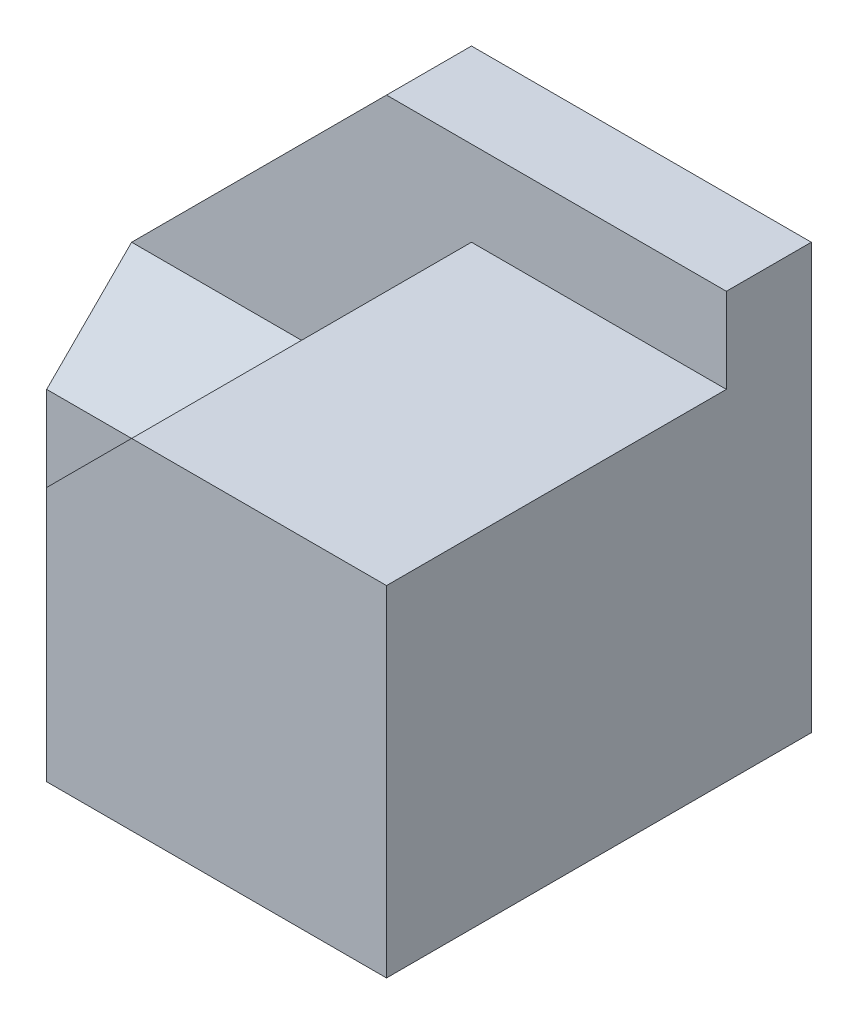
ISO-10303-21;
HEADER;
FILE_DESCRIPTION(('STEP AP214'),'2;1');
FILE_NAME('part.step','',(''),(''),'','','');
FILE_SCHEMA(('AUTOMOTIVE_DESIGN { 1 0 10303 214 1 1 1 1 }'));
ENDSEC;
DATA;
#1=APPLICATION_CONTEXT('core data for automotive mechanical design processes');
#2=APPLICATION_PROTOCOL_DEFINITION('international standard','automotive_design',2000,#1);
#3=PRODUCT_CONTEXT('',#1,'mechanical');
#4=PRODUCT('Part','Part','',(#3));
#5=PRODUCT_RELATED_PRODUCT_CATEGORY('part','',(#4));
#6=PRODUCT_DEFINITION_FORMATION('','',#4);
#7=PRODUCT_DEFINITION_CONTEXT('part definition',#1,'design');
#8=PRODUCT_DEFINITION('design','',#6,#7);
#9=PRODUCT_DEFINITION_SHAPE('','',#8);
#10=(LENGTH_UNIT() NAMED_UNIT(*) SI_UNIT(.MILLI.,.METRE.));
#11=(NAMED_UNIT(*) PLANE_ANGLE_UNIT() SI_UNIT($,.RADIAN.));
#12=(NAMED_UNIT(*) SI_UNIT($,.STERADIAN.) SOLID_ANGLE_UNIT());
#13=UNCERTAINTY_MEASURE_WITH_UNIT(LENGTH_MEASURE(1.E-05),#10,'distance_accuracy_value','');
#14=(GEOMETRIC_REPRESENTATION_CONTEXT(3) GLOBAL_UNCERTAINTY_ASSIGNED_CONTEXT((#13)) GLOBAL_UNIT_ASSIGNED_CONTEXT((#10,
#11,#12)) REPRESENTATION_CONTEXT('',''));
#15=CARTESIAN_POINT('',(0.,0.,0.));
#16=DIRECTION('',(0.,0.,1.));
#17=DIRECTION('',(1.,0.,0.));
#18=AXIS2_PLACEMENT_3D('',#15,#16,#17);
#19=CARTESIAN_POINT('',(0.,20.,0.));
#20=DIRECTION('',(0.707106781186547,-0.707106781186547,0.));
#21=DIRECTION('',(0.707106781186548,0.707106781186548,0.));
#22=AXIS2_PLACEMENT_3D('',#19,#20,#21);
#23=PLANE('',#22);
#24=DIRECTION('',(0.,0.,1.));
#25=VECTOR('',#24,1.);
#26=CARTESIAN_POINT('',(0.,20.,0.));
#27=LINE('',#26,#25);
#28=CARTESIAN_POINT('',(0.,20.,0.));
#29=VERTEX_POINT('',#28);
#30=CARTESIAN_POINT('',(0.,20.,10.));
#31=VERTEX_POINT('',#30);
#32=EDGE_CURVE('E172',#29,#31,#27,.T.);
#33=ORIENTED_EDGE('',*,*,#32,.T.);
#34=DIRECTION('',(0.707106781186548,0.707106781186548,0.));
#35=VECTOR('',#34,1.);
#36=CARTESIAN_POINT('',(0.,20.,10.));
#37=LINE('',#36,#35);
#38=CARTESIAN_POINT('',(30.,50.,10.));
#39=VERTEX_POINT('',#38);
#40=EDGE_CURVE('E11',#31,#39,#37,.T.);
#41=ORIENTED_EDGE('',*,*,#40,.T.);
#42=DIRECTION('',(0.,0.,1.));
#43=VECTOR('',#42,1.);
#44=CARTESIAN_POINT('',(30.,50.,0.));
#45=LINE('',#44,#43);
#46=CARTESIAN_POINT('',(30.,50.,0.));
#47=VERTEX_POINT('',#46);
#48=EDGE_CURVE('E55',#47,#39,#45,.T.);
#49=ORIENTED_EDGE('',*,*,#48,.F.);
#50=DIRECTION('',(0.707106781186547,0.707106781186547,0.));
#51=VECTOR('',#50,1.);
#52=CARTESIAN_POINT('',(0.,20.,0.));
#53=LINE('',#52,#51);
#54=EDGE_CURVE('E167',#29,#47,#53,.T.);
#55=ORIENTED_EDGE('',*,*,#54,.F.);
#56=EDGE_LOOP('',(#33,#41,#49,#55));
#57=FACE_BOUND('',#56,.T.);
#58=ADVANCED_FACE('F33',(#57),#23,.F.);
#59=CARTESIAN_POINT('',(0.,0.,50.));
#60=DIRECTION('',(1.,0.,0.));
#61=DIRECTION('',(0.,0.,-1.));
#62=AXIS2_PLACEMENT_3D('',#59,#60,#61);
#63=PLANE('',#62);
#64=DIRECTION('',(0.,-1.,0.));
#65=VECTOR('',#64,1.);
#66=CARTESIAN_POINT('',(0.,20.,20.));
#67=LINE('',#66,#65);
#68=CARTESIAN_POINT('',(0.,10.,20.));
#69=VERTEX_POINT('',#68);
#70=CARTESIAN_POINT('',(0.,0.,20.0000000000002));
#71=VERTEX_POINT('',#70);
#72=EDGE_CURVE('E150',#69,#71,#67,.T.);
#73=ORIENTED_EDGE('',*,*,#72,.F.);
#74=DIRECTION('',(0.,0.707106781186548,-0.707106781186547));
#75=VECTOR('',#74,1.);
#76=CARTESIAN_POINT('',(0.,20.,10.));
#77=LINE('',#76,#75);
#78=EDGE_CURVE('E139',#69,#31,#77,.T.);
#79=ORIENTED_EDGE('',*,*,#78,.T.);
#80=ORIENTED_EDGE('',*,*,#32,.F.);
#81=DIRECTION('',(0.,-1.,0.));
#82=VECTOR('',#81,1.);
#83=CARTESIAN_POINT('',(0.,0.,0.));
#84=LINE('',#83,#82);
#85=CARTESIAN_POINT('',(0.,0.,0.));
#86=VERTEX_POINT('',#85);
#87=EDGE_CURVE('E174',#29,#86,#84,.T.);
#88=ORIENTED_EDGE('',*,*,#87,.T.);
#89=DIRECTION('',(0.,0.,-1.));
#90=VECTOR('',#89,1.);
#91=CARTESIAN_POINT('',(0.,0.,50.));
#92=LINE('',#91,#90);
#93=EDGE_CURVE('E41',#71,#86,#92,.T.);
#94=ORIENTED_EDGE('',*,*,#93,.F.);
#95=EDGE_LOOP('',(#73,#79,#80,#88,#94));
#96=FACE_BOUND('',#95,.T.);
#97=ADVANCED_FACE('F35',(#96),#63,.F.);
#98=CARTESIAN_POINT('',(0.,0.,50.));
#99=DIRECTION('',(0.,1.,0.));
#100=DIRECTION('',(0.,0.,1.));
#101=AXIS2_PLACEMENT_3D('',#98,#99,#100);
#102=PLANE('',#101);
#103=DIRECTION('',(0.,0.,1.));
#104=VECTOR('',#103,1.);
#105=CARTESIAN_POINT('',(30.,0.,30.));
#106=LINE('',#105,#104);
#107=CARTESIAN_POINT('',(30.,0.,20.0000000000002));
#108=VERTEX_POINT('',#107);
#109=CARTESIAN_POINT('',(30.,0.,50.));
#110=VERTEX_POINT('',#109);
#111=EDGE_CURVE('E154',#108,#110,#106,.T.);
#112=ORIENTED_EDGE('',*,*,#111,.F.);
#113=DIRECTION('',(-1.,0.,0.));
#114=VECTOR('',#113,1.);
#115=CARTESIAN_POINT('',(30.,0.,20.0000000000002));
#116=LINE('',#115,#114);
#117=EDGE_CURVE('E131',#108,#71,#116,.T.);
#118=ORIENTED_EDGE('',*,*,#117,.T.);
#119=ORIENTED_EDGE('',*,*,#93,.T.);
#120=DIRECTION('',(1.,0.,0.));
#121=VECTOR('',#120,1.);
#122=CARTESIAN_POINT('',(0.,0.,0.));
#123=LINE('',#122,#121);
#124=CARTESIAN_POINT('',(70.,0.,0.));
#125=VERTEX_POINT('',#124);
#126=EDGE_CURVE('E186',#86,#125,#123,.T.);
#127=ORIENTED_EDGE('',*,*,#126,.T.);
#128=DIRECTION('',(0.,0.,-1.));
#129=VECTOR('',#128,1.);
#130=CARTESIAN_POINT('',(70.,0.,50.));
#131=LINE('',#130,#129);
#132=CARTESIAN_POINT('',(70.,0.,50.));
#133=VERTEX_POINT('',#132);
#134=EDGE_CURVE('E194',#133,#125,#131,.T.);
#135=ORIENTED_EDGE('',*,*,#134,.F.);
#136=DIRECTION('',(1.,0.,0.));
#137=VECTOR('',#136,1.);
#138=CARTESIAN_POINT('',(0.,0.,50.));
#139=LINE('',#138,#137);
#140=EDGE_CURVE('E177',#110,#133,#139,.T.);
#141=ORIENTED_EDGE('',*,*,#140,.F.);
#142=EDGE_LOOP('',(#112,#118,#119,#127,#135,#141));
#143=FACE_BOUND('',#142,.T.);
#144=ADVANCED_FACE('F198',(#143),#102,.F.);
#145=CARTESIAN_POINT('',(0.,0.,50.));
#146=DIRECTION('',(0.,0.,-1.));
#147=DIRECTION('',(-1.,0.,0.));
#148=AXIS2_PLACEMENT_3D('',#145,#146,#147);
#149=PLANE('',#148);
#150=DIRECTION('',(0.,-1.,0.));
#151=VECTOR('',#150,1.);
#152=CARTESIAN_POINT('',(30.,0.,50.));
#153=LINE('',#152,#151);
#154=CARTESIAN_POINT('',(30.,30.,50.));
#155=VERTEX_POINT('',#154);
#156=EDGE_CURVE('E118',#155,#110,#153,.T.);
#157=ORIENTED_EDGE('',*,*,#156,.T.);
#158=ORIENTED_EDGE('',*,*,#140,.T.);
#159=DIRECTION('',(0.,1.,0.));
#160=VECTOR('',#159,1.);
#161=CARTESIAN_POINT('',(70.,0.,50.));
#162=LINE('',#161,#160);
#163=CARTESIAN_POINT('',(70.,40.,50.));
#164=VERTEX_POINT('',#163);
#165=EDGE_CURVE('E179',#133,#164,#162,.T.);
#166=ORIENTED_EDGE('',*,*,#165,.T.);
#167=DIRECTION('',(1.,0.,0.));
#168=VECTOR('',#167,1.);
#169=CARTESIAN_POINT('',(20.,40.,50.));
#170=LINE('',#169,#168);
#171=CARTESIAN_POINT('',(40.,40.,50.));
#172=VERTEX_POINT('',#171);
#173=EDGE_CURVE('E163',#172,#164,#170,.T.);
#174=ORIENTED_EDGE('',*,*,#173,.F.);
#175=DIRECTION('',(-0.707106781186548,-0.707106781186547,0.));
#176=VECTOR('',#175,1.);
#177=CARTESIAN_POINT('',(0.,0.,50.));
#178=LINE('',#177,#176);
#179=EDGE_CURVE('E123',#172,#155,#178,.T.);
#180=ORIENTED_EDGE('',*,*,#179,.T.);
#181=EDGE_LOOP('',(#157,#158,#166,#174,#180));
#182=FACE_BOUND('',#181,.T.);
#183=ADVANCED_FACE('F216',(#182),#149,.F.);
#184=CARTESIAN_POINT('',(20.,40.,50.));
#185=DIRECTION('',(0.,-1.,0.));
#186=DIRECTION('',(0.,0.,-1.));
#187=AXIS2_PLACEMENT_3D('',#184,#185,#186);
#188=PLANE('',#187);
#189=DIRECTION('',(1.,0.,0.));
#190=VECTOR('',#189,1.);
#191=CARTESIAN_POINT('',(20.,40.,10.));
#192=LINE('',#191,#190);
#193=CARTESIAN_POINT('',(40.,40.,10.));
#194=VERTEX_POINT('',#193);
#195=CARTESIAN_POINT('',(70.,40.,10.));
#196=VERTEX_POINT('',#195);
#197=EDGE_CURVE('E168',#194,#196,#192,.T.);
#198=ORIENTED_EDGE('',*,*,#197,.F.);
#199=DIRECTION('',(0.,0.,1.));
#200=VECTOR('',#199,1.);
#201=CARTESIAN_POINT('',(40.,40.,30.));
#202=LINE('',#201,#200);
#203=EDGE_CURVE('E122',#194,#172,#202,.T.);
#204=ORIENTED_EDGE('',*,*,#203,.T.);
#205=ORIENTED_EDGE('',*,*,#173,.T.);
#206=DIRECTION('',(0.,0.,-1.));
#207=VECTOR('',#206,1.);
#208=CARTESIAN_POINT('',(70.,40.,50.));
#209=LINE('',#208,#207);
#210=EDGE_CURVE('E156',#164,#196,#209,.T.);
#211=ORIENTED_EDGE('',*,*,#210,.T.);
#212=EDGE_LOOP('',(#198,#204,#205,#211));
#213=FACE_BOUND('',#212,.T.);
#214=ADVANCED_FACE('F221',(#213),#188,.F.);
#215=CARTESIAN_POINT('',(70.,0.,50.));
#216=DIRECTION('',(-1.,0.,0.));
#217=DIRECTION('',(0.,0.,1.));
#218=AXIS2_PLACEMENT_3D('',#215,#216,#217);
#219=PLANE('',#218);
#220=DIRECTION('',(0.,0.,-1.));
#221=VECTOR('',#220,1.);
#222=CARTESIAN_POINT('',(70.,50.,50.));
#223=LINE('',#222,#221);
#224=CARTESIAN_POINT('',(70.,50.,10.));
#225=VERTEX_POINT('',#224);
#226=CARTESIAN_POINT('',(70.,50.,0.));
#227=VERTEX_POINT('',#226);
#228=EDGE_CURVE('E183',#225,#227,#223,.T.);
#229=ORIENTED_EDGE('',*,*,#228,.F.);
#230=DIRECTION('',(0.,1.,0.));
#231=VECTOR('',#230,1.);
#232=CARTESIAN_POINT('',(70.,50.,10.));
#233=LINE('',#232,#231);
#234=EDGE_CURVE('E161',#196,#225,#233,.T.);
#235=ORIENTED_EDGE('',*,*,#234,.F.);
#236=ORIENTED_EDGE('',*,*,#210,.F.);
#237=ORIENTED_EDGE('',*,*,#165,.F.);
#238=ORIENTED_EDGE('',*,*,#134,.T.);
#239=DIRECTION('',(0.,1.,0.));
#240=VECTOR('',#239,1.);
#241=CARTESIAN_POINT('',(70.,0.,0.));
#242=LINE('',#241,#240);
#243=EDGE_CURVE('E188',#125,#227,#242,.T.);
#244=ORIENTED_EDGE('',*,*,#243,.T.);
#245=EDGE_LOOP('',(#229,#235,#236,#237,#238,#244));
#246=FACE_BOUND('',#245,.T.);
#247=ADVANCED_FACE('F210',(#246),#219,.F.);
#248=CARTESIAN_POINT('',(0.,50.,50.));
#249=DIRECTION('',(0.,-1.,0.));
#250=DIRECTION('',(0.,0.,-1.));
#251=AXIS2_PLACEMENT_3D('',#248,#249,#250);
#252=PLANE('',#251);
#253=ORIENTED_EDGE('',*,*,#48,.T.);
#254=DIRECTION('',(1.,0.,0.));
#255=VECTOR('',#254,1.);
#256=CARTESIAN_POINT('',(20.,50.,10.));
#257=LINE('',#256,#255);
#258=EDGE_CURVE('E164',#39,#225,#257,.T.);
#259=ORIENTED_EDGE('',*,*,#258,.T.);
#260=ORIENTED_EDGE('',*,*,#228,.T.);
#261=DIRECTION('',(-1.,0.,0.));
#262=VECTOR('',#261,1.);
#263=CARTESIAN_POINT('',(0.,50.,0.));
#264=LINE('',#263,#262);
#265=EDGE_CURVE('E180',#227,#47,#264,.T.);
#266=ORIENTED_EDGE('',*,*,#265,.T.);
#267=EDGE_LOOP('',(#253,#259,#260,#266));
#268=FACE_BOUND('',#267,.T.);
#269=ADVANCED_FACE('F244',(#268),#252,.F.);
#270=CARTESIAN_POINT('',(0.,0.,0.));
#271=DIRECTION('',(0.,0.,-1.));
#272=DIRECTION('',(-1.,0.,0.));
#273=AXIS2_PLACEMENT_3D('',#270,#271,#272);
#274=PLANE('',#273);
#275=ORIENTED_EDGE('',*,*,#54,.T.);
#276=ORIENTED_EDGE('',*,*,#265,.F.);
#277=ORIENTED_EDGE('',*,*,#243,.F.);
#278=ORIENTED_EDGE('',*,*,#126,.F.);
#279=ORIENTED_EDGE('',*,*,#87,.F.);
#280=EDGE_LOOP('',(#275,#276,#277,#278,#279));
#281=FACE_BOUND('',#280,.T.);
#282=ADVANCED_FACE('F206',(#281),#274,.T.);
#283=CARTESIAN_POINT('',(20.,50.,10.));
#284=DIRECTION('',(0.,0.,-1.));
#285=DIRECTION('',(-1.,0.,0.));
#286=AXIS2_PLACEMENT_3D('',#283,#284,#285);
#287=PLANE('',#286);
#288=ORIENTED_EDGE('',*,*,#40,.F.);
#289=DIRECTION('',(-1.,0.,0.));
#290=VECTOR('',#289,1.);
#291=CARTESIAN_POINT('',(43.,20.,10.));
#292=LINE('',#291,#290);
#293=CARTESIAN_POINT('',(20.,20.,9.99999999999999));
#294=VERTEX_POINT('',#293);
#295=EDGE_CURVE('E48',#294,#31,#292,.T.);
#296=ORIENTED_EDGE('',*,*,#295,.F.);
#297=DIRECTION('',(0.707106781186547,0.707106781186547,0.));
#298=VECTOR('',#297,1.);
#299=CARTESIAN_POINT('',(40.,40.,10.));
#300=LINE('',#299,#298);
#301=EDGE_CURVE('E133',#294,#194,#300,.T.);
#302=ORIENTED_EDGE('',*,*,#301,.T.);
#303=ORIENTED_EDGE('',*,*,#197,.T.);
#304=ORIENTED_EDGE('',*,*,#234,.T.);
#305=ORIENTED_EDGE('',*,*,#258,.F.);
#306=EDGE_LOOP('',(#288,#296,#302,#303,#304,#305));
#307=FACE_BOUND('',#306,.T.);
#308=ADVANCED_FACE('F222',(#307),#287,.F.);
#309=CARTESIAN_POINT('',(30.,0.,30.));
#310=DIRECTION('',(-1.,0.,0.));
#311=DIRECTION('',(0.,-1.,0.));
#312=AXIS2_PLACEMENT_3D('',#309,#310,#311);
#313=PLANE('',#312);
#314=ORIENTED_EDGE('',*,*,#156,.F.);
#315=DIRECTION('',(0.,0.,1.));
#316=VECTOR('',#315,1.);
#317=CARTESIAN_POINT('',(30.,30.,30.));
#318=LINE('',#317,#316);
#319=CARTESIAN_POINT('',(30.,30.,20.));
#320=VERTEX_POINT('',#319);
#321=EDGE_CURVE('E112',#320,#155,#318,.T.);
#322=ORIENTED_EDGE('',*,*,#321,.F.);
#323=DIRECTION('',(0.,-1.,0.));
#324=VECTOR('',#323,1.);
#325=CARTESIAN_POINT('',(30.,10.,20.));
#326=LINE('',#325,#324);
#327=EDGE_CURVE('E115',#320,#108,#326,.T.);
#328=ORIENTED_EDGE('',*,*,#327,.T.);
#329=ORIENTED_EDGE('',*,*,#111,.T.);
#330=EDGE_LOOP('',(#314,#322,#328,#329));
#331=FACE_BOUND('',#330,.T.);
#332=ADVANCED_FACE('F114',(#331),#313,.T.);
#333=CARTESIAN_POINT('',(0.,0.,30.));
#334=DIRECTION('',(-0.707106781186547,0.707106781186548,0.));
#335=DIRECTION('',(-0.707106781186548,-0.707106781186547,0.));
#336=AXIS2_PLACEMENT_3D('',#333,#334,#335);
#337=PLANE('',#336);
#338=DIRECTION('',(-0.707106781186548,-0.707106781186548,0.));
#339=VECTOR('',#338,1.);
#340=CARTESIAN_POINT('',(30.,30.,20.));
#341=LINE('',#340,#339);
#342=CARTESIAN_POINT('',(10.,10.,20.));
#343=VERTEX_POINT('',#342);
#344=EDGE_CURVE('E128',#320,#343,#341,.T.);
#345=ORIENTED_EDGE('',*,*,#344,.F.);
#346=ORIENTED_EDGE('',*,*,#321,.T.);
#347=ORIENTED_EDGE('',*,*,#179,.F.);
#348=ORIENTED_EDGE('',*,*,#203,.F.);
#349=ORIENTED_EDGE('',*,*,#301,.F.);
#350=DIRECTION('',(0.577350269189626,0.577350269189626,-0.577350269189626));
#351=VECTOR('',#350,1.);
#352=CARTESIAN_POINT('',(0.,0.,30.));
#353=LINE('',#352,#351);
#354=EDGE_CURVE('E137',#343,#294,#353,.T.);
#355=ORIENTED_EDGE('',*,*,#354,.F.);
#356=EDGE_LOOP('',(#345,#346,#347,#348,#349,#355));
#357=FACE_BOUND('',#356,.T.);
#358=ADVANCED_FACE('F135',(#357),#337,.T.);
#359=CARTESIAN_POINT('',(0.,0.,20.));
#360=DIRECTION('',(0.,0.,1.));
#361=DIRECTION('',(1.,0.,0.));
#362=AXIS2_PLACEMENT_3D('',#359,#360,#361);
#363=PLANE('',#362);
#364=DIRECTION('',(1.,0.,0.));
#365=VECTOR('',#364,1.);
#366=CARTESIAN_POINT('',(10.,10.,20.));
#367=LINE('',#366,#365);
#368=EDGE_CURVE('E146',#69,#343,#367,.T.);
#369=ORIENTED_EDGE('',*,*,#368,.F.);
#370=ORIENTED_EDGE('',*,*,#72,.T.);
#371=ORIENTED_EDGE('',*,*,#117,.F.);
#372=ORIENTED_EDGE('',*,*,#327,.F.);
#373=ORIENTED_EDGE('',*,*,#344,.T.);
#374=EDGE_LOOP('',(#369,#370,#371,#372,#373));
#375=FACE_BOUND('',#374,.T.);
#376=ADVANCED_FACE('F127',(#375),#363,.T.);
#377=CARTESIAN_POINT('',(43.,20.,10.));
#378=DIRECTION('',(0.,0.707106781186547,0.707106781186548));
#379=DIRECTION('',(0.,-0.707106781186548,0.707106781186547));
#380=AXIS2_PLACEMENT_3D('',#377,#378,#379);
#381=PLANE('',#380);
#382=ORIENTED_EDGE('',*,*,#368,.T.);
#383=ORIENTED_EDGE('',*,*,#354,.T.);
#384=ORIENTED_EDGE('',*,*,#295,.T.);
#385=ORIENTED_EDGE('',*,*,#78,.F.);
#386=EDGE_LOOP('',(#382,#383,#384,#385));
#387=FACE_BOUND('',#386,.T.);
#388=ADVANCED_FACE('F224',(#387),#381,.T.);
#389=CLOSED_SHELL('',(#58,#97,#144,#183,#214,#247,#269,#282,#308,#332,#358,#376,#388));
#390=MANIFOLD_SOLID_BREP('B2',#389);
#391=ADVANCED_BREP_SHAPE_REPRESENTATION('',(#18,#390),#14);
#392=SHAPE_DEFINITION_REPRESENTATION(#9,#391);
ENDSEC;
END-ISO-10303-21;
